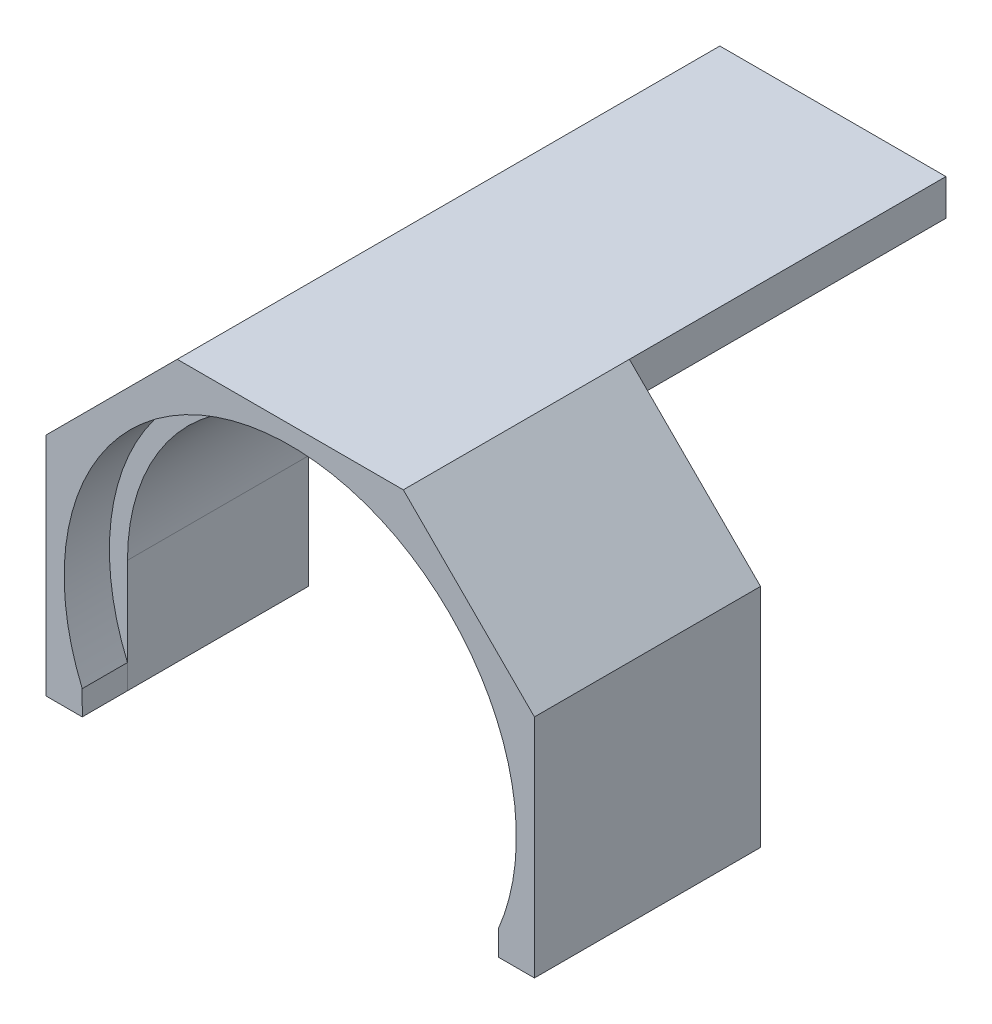
ISO-10303-21;
HEADER;
FILE_DESCRIPTION(('STEP AP214'),'2;1');
FILE_NAME('part.step','',(''),(''),'','','');
FILE_SCHEMA(('AUTOMOTIVE_DESIGN { 1 0 10303 214 1 1 1 1 }'));
ENDSEC;
DATA;
#1=APPLICATION_CONTEXT('core data for automotive mechanical design processes');
#2=APPLICATION_PROTOCOL_DEFINITION('international standard','automotive_design',2000,#1);
#3=PRODUCT_CONTEXT('',#1,'mechanical');
#4=PRODUCT('Part','Part','',(#3));
#5=PRODUCT_RELATED_PRODUCT_CATEGORY('part','',(#4));
#6=PRODUCT_DEFINITION_FORMATION('','',#4);
#7=PRODUCT_DEFINITION_CONTEXT('part definition',#1,'design');
#8=PRODUCT_DEFINITION('design','',#6,#7);
#9=PRODUCT_DEFINITION_SHAPE('','',#8);
#10=(LENGTH_UNIT() NAMED_UNIT(*) SI_UNIT(.MILLI.,.METRE.));
#11=(NAMED_UNIT(*) PLANE_ANGLE_UNIT() SI_UNIT($,.RADIAN.));
#12=(NAMED_UNIT(*) SI_UNIT($,.STERADIAN.) SOLID_ANGLE_UNIT());
#13=UNCERTAINTY_MEASURE_WITH_UNIT(LENGTH_MEASURE(1.E-05),#10,'distance_accuracy_value','');
#14=(GEOMETRIC_REPRESENTATION_CONTEXT(3) GLOBAL_UNCERTAINTY_ASSIGNED_CONTEXT((#13)) GLOBAL_UNIT_ASSIGNED_CONTEXT((#10,
#11,#12)) REPRESENTATION_CONTEXT('',''));
#15=CARTESIAN_POINT('',(0.,0.,0.));
#16=DIRECTION('',(0.,0.,1.));
#17=DIRECTION('',(1.,0.,0.));
#18=AXIS2_PLACEMENT_3D('',#15,#16,#17);
#19=CARTESIAN_POINT('',(0.,0.,110.));
#20=DIRECTION('',(0.,0.,1.));
#21=DIRECTION('',(1.,0.,0.));
#22=AXIS2_PLACEMENT_3D('',#19,#20,#21);
#23=PLANE('',#22);
#24=CARTESIAN_POINT('',(0.,-50.,110.));
#25=DIRECTION('',(0.,0.,-1.));
#26=DIRECTION('',(1.,0.,0.));
#27=AXIS2_PLACEMENT_3D('',#24,#25,#26);
#28=CIRCLE('',#27,50.);
#29=CARTESIAN_POINT('',(-46.0023323000082,-69.5849645146475,110.));
#30=VERTEX_POINT('',#29);
#31=CARTESIAN_POINT('',(46.,-69.5959179422654,110.));
#32=VERTEX_POINT('',#31);
#33=EDGE_CURVE('E54',#30,#32,#28,.T.);
#34=ORIENTED_EDGE('',*,*,#33,.F.);
#35=DIRECTION('',(0.,1.,0.));
#36=VECTOR('',#35,1.);
#37=CARTESIAN_POINT('',(-46.,-50.,110.));
#38=LINE('',#37,#36);
#39=CARTESIAN_POINT('',(-46.,-50.,110.));
#40=VERTEX_POINT('',#39);
#41=EDGE_CURVE('E175',#30,#40,#38,.T.);
#42=ORIENTED_EDGE('',*,*,#41,.T.);
#43=CARTESIAN_POINT('',(0.,-50.,110.));
#44=DIRECTION('',(0.,0.,-1.));
#45=DIRECTION('',(1.,0.,0.));
#46=AXIS2_PLACEMENT_3D('',#43,#44,#45);
#47=CIRCLE('',#46,46.);
#48=CARTESIAN_POINT('',(46.,-50.,110.));
#49=VERTEX_POINT('',#48);
#50=EDGE_CURVE('E402',#40,#49,#47,.T.);
#51=ORIENTED_EDGE('',*,*,#50,.T.);
#52=DIRECTION('',(0.,-1.,0.));
#53=VECTOR('',#52,1.);
#54=CARTESIAN_POINT('',(46.,-50.,110.));
#55=LINE('',#54,#53);
#56=EDGE_CURVE('E401',#49,#32,#55,.T.);
#57=ORIENTED_EDGE('',*,*,#56,.T.);
#58=EDGE_LOOP('',(#34,#42,#51,#57));
#59=FACE_BOUND('',#58,.T.);
#60=ADVANCED_FACE('F36',(#59),#23,.T.);
#61=CARTESIAN_POINT('',(-25.,4.,0.));
#62=DIRECTION('',(-1.,0.,0.));
#63=DIRECTION('',(0.,0.,1.));
#64=AXIS2_PLACEMENT_3D('',#61,#62,#63);
#65=PLANE('',#64);
#66=DIRECTION('',(0.,0.,1.));
#67=VECTOR('',#66,1.);
#68=CARTESIAN_POINT('',(-25.,-4.,0.));
#69=LINE('',#68,#67);
#70=CARTESIAN_POINT('',(-25.,-4.,0.));
#71=VERTEX_POINT('',#70);
#72=CARTESIAN_POINT('',(-25.,-4.,70.));
#73=VERTEX_POINT('',#72);
#74=EDGE_CURVE('E358',#71,#73,#69,.T.);
#75=ORIENTED_EDGE('',*,*,#74,.T.);
#76=DIRECTION('',(0.,1.,0.));
#77=VECTOR('',#76,1.);
#78=CARTESIAN_POINT('',(-25.,4.,70.));
#79=LINE('',#78,#77);
#80=CARTESIAN_POINT('',(-25.,4.,70.));
#81=VERTEX_POINT('',#80);
#82=EDGE_CURVE('E351',#73,#81,#79,.T.);
#83=ORIENTED_EDGE('',*,*,#82,.T.);
#84=DIRECTION('',(0.,0.,1.));
#85=VECTOR('',#84,1.);
#86=CARTESIAN_POINT('',(-25.,4.,0.));
#87=LINE('',#86,#85);
#88=CARTESIAN_POINT('',(-25.,4.,0.));
#89=VERTEX_POINT('',#88);
#90=EDGE_CURVE('E361',#89,#81,#87,.T.);
#91=ORIENTED_EDGE('',*,*,#90,.F.);
#92=DIRECTION('',(0.,-1.,0.));
#93=VECTOR('',#92,1.);
#94=CARTESIAN_POINT('',(-25.,4.,0.));
#95=LINE('',#94,#93);
#96=EDGE_CURVE('E354',#89,#71,#95,.T.);
#97=ORIENTED_EDGE('',*,*,#96,.T.);
#98=EDGE_LOOP('',(#75,#83,#91,#97));
#99=FACE_BOUND('',#98,.T.);
#100=ADVANCED_FACE('F267',(#99),#65,.T.);
#101=CARTESIAN_POINT('',(-25.,-4.,0.));
#102=DIRECTION('',(0.,-1.,0.));
#103=DIRECTION('',(1.,0.,0.));
#104=AXIS2_PLACEMENT_3D('',#101,#102,#103);
#105=PLANE('',#104);
#106=DIRECTION('',(0.,0.,1.));
#107=VECTOR('',#106,1.);
#108=CARTESIAN_POINT('',(25.,-4.,0.));
#109=LINE('',#108,#107);
#110=CARTESIAN_POINT('',(25.,-4.,0.));
#111=VERTEX_POINT('',#110);
#112=CARTESIAN_POINT('',(25.,-4.,70.));
#113=VERTEX_POINT('',#112);
#114=EDGE_CURVE('E46',#111,#113,#109,.T.);
#115=ORIENTED_EDGE('',*,*,#114,.T.);
#116=DIRECTION('',(-1.,0.,0.));
#117=VECTOR('',#116,1.);
#118=CARTESIAN_POINT('',(-25.,-4.,70.));
#119=LINE('',#118,#117);
#120=CARTESIAN_POINT('',(0.,-4.,70.));
#121=VERTEX_POINT('',#120);
#122=EDGE_CURVE('E347',#113,#121,#119,.T.);
#123=ORIENTED_EDGE('',*,*,#122,.T.);
#124=EDGE_CURVE('E350',#121,#73,#119,.T.);
#125=ORIENTED_EDGE('',*,*,#124,.T.);
#126=ORIENTED_EDGE('',*,*,#74,.F.);
#127=DIRECTION('',(1.,0.,0.));
#128=VECTOR('',#127,1.);
#129=CARTESIAN_POINT('',(-25.,-4.,0.));
#130=LINE('',#129,#128);
#131=EDGE_CURVE('E357',#71,#111,#130,.T.);
#132=ORIENTED_EDGE('',*,*,#131,.T.);
#133=EDGE_LOOP('',(#115,#123,#125,#126,#132));
#134=FACE_BOUND('',#133,.T.);
#135=ADVANCED_FACE('F274',(#134),#105,.T.);
#136=CARTESIAN_POINT('',(25.,4.,0.));
#137=DIRECTION('',(1.,0.,0.));
#138=DIRECTION('',(0.,0.,-1.));
#139=AXIS2_PLACEMENT_3D('',#136,#137,#138);
#140=PLANE('',#139);
#141=DIRECTION('',(0.,0.,1.));
#142=VECTOR('',#141,1.);
#143=CARTESIAN_POINT('',(25.,4.,0.));
#144=LINE('',#143,#142);
#145=CARTESIAN_POINT('',(25.,4.,0.));
#146=VERTEX_POINT('',#145);
#147=CARTESIAN_POINT('',(25.,4.,70.));
#148=VERTEX_POINT('',#147);
#149=EDGE_CURVE('E11',#146,#148,#144,.T.);
#150=ORIENTED_EDGE('',*,*,#149,.T.);
#151=DIRECTION('',(0.,-1.,0.));
#152=VECTOR('',#151,1.);
#153=CARTESIAN_POINT('',(25.,4.,70.));
#154=LINE('',#153,#152);
#155=EDGE_CURVE('E331',#148,#113,#154,.T.);
#156=ORIENTED_EDGE('',*,*,#155,.T.);
#157=ORIENTED_EDGE('',*,*,#114,.F.);
#158=DIRECTION('',(0.,1.,0.));
#159=VECTOR('',#158,1.);
#160=CARTESIAN_POINT('',(25.,4.,0.));
#161=LINE('',#160,#159);
#162=EDGE_CURVE('E366',#111,#146,#161,.T.);
#163=ORIENTED_EDGE('',*,*,#162,.T.);
#164=EDGE_LOOP('',(#150,#156,#157,#163));
#165=FACE_BOUND('',#164,.T.);
#166=ADVANCED_FACE('F271',(#165),#140,.T.);
#167=CARTESIAN_POINT('',(0.,0.,0.));
#168=DIRECTION('',(0.,0.,1.));
#169=DIRECTION('',(1.,0.,0.));
#170=AXIS2_PLACEMENT_3D('',#167,#168,#169);
#171=PLANE('',#170);
#172=ORIENTED_EDGE('',*,*,#96,.F.);
#173=DIRECTION('',(-1.,0.,0.));
#174=VECTOR('',#173,1.);
#175=CARTESIAN_POINT('',(-25.,4.,0.));
#176=LINE('',#175,#174);
#177=EDGE_CURVE('E62',#146,#89,#176,.T.);
#178=ORIENTED_EDGE('',*,*,#177,.F.);
#179=ORIENTED_EDGE('',*,*,#162,.F.);
#180=ORIENTED_EDGE('',*,*,#131,.F.);
#181=EDGE_LOOP('',(#172,#178,#179,#180));
#182=FACE_BOUND('',#181,.T.);
#183=ADVANCED_FACE('F38',(#182),#171,.F.);
#184=CARTESIAN_POINT('',(-25.,4.,0.));
#185=DIRECTION('',(0.,1.,0.));
#186=DIRECTION('',(0.,0.,1.));
#187=AXIS2_PLACEMENT_3D('',#184,#185,#186);
#188=PLANE('',#187);
#189=DIRECTION('',(0.,0.,1.));
#190=VECTOR('',#189,1.);
#191=CARTESIAN_POINT('',(25.,4.,70.));
#192=LINE('',#191,#190);
#193=CARTESIAN_POINT('',(25.,4.,120.));
#194=VERTEX_POINT('',#193);
#195=EDGE_CURVE('E329',#148,#194,#192,.T.);
#196=ORIENTED_EDGE('',*,*,#195,.F.);
#197=ORIENTED_EDGE('',*,*,#149,.F.);
#198=ORIENTED_EDGE('',*,*,#177,.T.);
#199=ORIENTED_EDGE('',*,*,#90,.T.);
#200=DIRECTION('',(0.,0.,1.));
#201=VECTOR('',#200,1.);
#202=CARTESIAN_POINT('',(-25.,4.,70.));
#203=LINE('',#202,#201);
#204=CARTESIAN_POINT('',(-25.,4.,120.));
#205=VERTEX_POINT('',#204);
#206=EDGE_CURVE('E342',#81,#205,#203,.T.);
#207=ORIENTED_EDGE('',*,*,#206,.T.);
#208=DIRECTION('',(-1.,0.,0.));
#209=VECTOR('',#208,1.);
#210=CARTESIAN_POINT('',(-25.,4.,120.));
#211=LINE('',#210,#209);
#212=EDGE_CURVE('E312',#194,#205,#211,.T.);
#213=ORIENTED_EDGE('',*,*,#212,.F.);
#214=EDGE_LOOP('',(#196,#197,#198,#199,#207,#213));
#215=FACE_BOUND('',#214,.T.);
#216=ADVANCED_FACE('F228',(#215),#188,.T.);
#217=CARTESIAN_POINT('',(0.,-50.,70.));
#218=DIRECTION('',(0.,0.,1.));
#219=DIRECTION('',(1.,0.,0.));
#220=AXIS2_PLACEMENT_3D('',#217,#218,#219);
#221=CYLINDRICAL_SURFACE('',#220,46.);
#222=CARTESIAN_POINT('',(0.,-50.,70.));
#223=DIRECTION('',(0.,0.,-1.));
#224=DIRECTION('',(1.,0.,0.));
#225=AXIS2_PLACEMENT_3D('',#222,#223,#224);
#226=CIRCLE('',#225,46.);
#227=CARTESIAN_POINT('',(-46.,-50.,70.));
#228=VERTEX_POINT('',#227);
#229=EDGE_CURVE('E387',#228,#121,#226,.T.);
#230=ORIENTED_EDGE('',*,*,#229,.T.);
#231=CARTESIAN_POINT('',(46.,-50.,70.));
#232=VERTEX_POINT('',#231);
#233=EDGE_CURVE('E382',#121,#232,#226,.T.);
#234=ORIENTED_EDGE('',*,*,#233,.T.);
#235=DIRECTION('',(0.,0.,1.));
#236=VECTOR('',#235,1.);
#237=CARTESIAN_POINT('',(46.,-50.,70.));
#238=LINE('',#237,#236);
#239=EDGE_CURVE('E337',#232,#49,#238,.T.);
#240=ORIENTED_EDGE('',*,*,#239,.T.);
#241=ORIENTED_EDGE('',*,*,#50,.F.);
#242=DIRECTION('',(0.,0.,1.));
#243=VECTOR('',#242,1.);
#244=CARTESIAN_POINT('',(-46.,-50.,70.));
#245=LINE('',#244,#243);
#246=EDGE_CURVE('E339',#228,#40,#245,.T.);
#247=ORIENTED_EDGE('',*,*,#246,.F.);
#248=EDGE_LOOP('',(#230,#234,#240,#241,#247));
#249=FACE_BOUND('',#248,.T.);
#250=ADVANCED_FACE('F225',(#249),#221,.F.);
#251=CARTESIAN_POINT('',(0.,-50.,70.));
#252=DIRECTION('',(0.,0.,1.));
#253=DIRECTION('',(1.,0.,0.));
#254=AXIS2_PLACEMENT_3D('',#251,#252,#253);
#255=PLANE('',#254);
#256=ORIENTED_EDGE('',*,*,#82,.F.);
#257=ORIENTED_EDGE('',*,*,#124,.F.);
#258=ORIENTED_EDGE('',*,*,#229,.F.);
#259=DIRECTION('',(0.,1.,0.));
#260=VECTOR('',#259,1.);
#261=CARTESIAN_POINT('',(-46.,-50.,70.));
#262=LINE('',#261,#260);
#263=CARTESIAN_POINT('',(-46.,-75.,70.));
#264=VERTEX_POINT('',#263);
#265=EDGE_CURVE('E388',#264,#228,#262,.T.);
#266=ORIENTED_EDGE('',*,*,#265,.F.);
#267=DIRECTION('',(1.,0.,0.));
#268=VECTOR('',#267,1.);
#269=CARTESIAN_POINT('',(-54.,-75.,70.));
#270=LINE('',#269,#268);
#271=CARTESIAN_POINT('',(-54.,-75.,70.));
#272=VERTEX_POINT('',#271);
#273=EDGE_CURVE('E410',#272,#264,#270,.T.);
#274=ORIENTED_EDGE('',*,*,#273,.F.);
#275=DIRECTION('',(0.,-1.,0.));
#276=VECTOR('',#275,1.);
#277=CARTESIAN_POINT('',(-54.,-25.,70.));
#278=LINE('',#277,#276);
#279=CARTESIAN_POINT('',(-54.,-25.,70.));
#280=VERTEX_POINT('',#279);
#281=EDGE_CURVE('E297',#280,#272,#278,.T.);
#282=ORIENTED_EDGE('',*,*,#281,.F.);
#283=DIRECTION('',(-0.707106781186548,-0.707106781186548,0.));
#284=VECTOR('',#283,1.);
#285=CARTESIAN_POINT('',(-54.,-25.,70.));
#286=LINE('',#285,#284);
#287=EDGE_CURVE('E380',#81,#280,#286,.T.);
#288=ORIENTED_EDGE('',*,*,#287,.F.);
#289=EDGE_LOOP('',(#256,#257,#258,#266,#274,#282,#288));
#290=FACE_BOUND('',#289,.T.);
#291=ADVANCED_FACE('F209',(#290),#255,.F.);
#292=CARTESIAN_POINT('',(25.,4.,70.));
#293=DIRECTION('',(0.707106781186548,0.707106781186548,0.));
#294=DIRECTION('',(-0.707106781186548,0.707106781186548,0.));
#295=AXIS2_PLACEMENT_3D('',#292,#293,#294);
#296=PLANE('',#295);
#297=ORIENTED_EDGE('',*,*,#195,.T.);
#298=DIRECTION('',(-0.707106781186548,0.707106781186548,0.));
#299=VECTOR('',#298,1.);
#300=CARTESIAN_POINT('',(25.,4.,120.));
#301=LINE('',#300,#299);
#302=CARTESIAN_POINT('',(54.,-25.,120.));
#303=VERTEX_POINT('',#302);
#304=EDGE_CURVE('E314',#303,#194,#301,.T.);
#305=ORIENTED_EDGE('',*,*,#304,.F.);
#306=DIRECTION('',(0.,0.,1.));
#307=VECTOR('',#306,1.);
#308=CARTESIAN_POINT('',(54.,-25.,70.));
#309=LINE('',#308,#307);
#310=CARTESIAN_POINT('',(54.,-25.,70.));
#311=VERTEX_POINT('',#310);
#312=EDGE_CURVE('E325',#311,#303,#309,.T.);
#313=ORIENTED_EDGE('',*,*,#312,.F.);
#314=DIRECTION('',(-0.707106781186548,0.707106781186548,0.));
#315=VECTOR('',#314,1.);
#316=CARTESIAN_POINT('',(25.,4.,70.));
#317=LINE('',#316,#315);
#318=EDGE_CURVE('E344',#311,#148,#317,.T.);
#319=ORIENTED_EDGE('',*,*,#318,.T.);
#320=EDGE_LOOP('',(#297,#305,#313,#319));
#321=FACE_BOUND('',#320,.T.);
#322=ADVANCED_FACE('F210',(#321),#296,.T.);
#323=CARTESIAN_POINT('',(54.,-25.,70.));
#324=DIRECTION('',(1.,0.,0.));
#325=DIRECTION('',(0.,1.,0.));
#326=AXIS2_PLACEMENT_3D('',#323,#324,#325);
#327=PLANE('',#326);
#328=ORIENTED_EDGE('',*,*,#312,.T.);
#329=DIRECTION('',(0.,1.,0.));
#330=VECTOR('',#329,1.);
#331=CARTESIAN_POINT('',(54.,-25.,120.));
#332=LINE('',#331,#330);
#333=CARTESIAN_POINT('',(54.,-75.,120.));
#334=VERTEX_POINT('',#333);
#335=EDGE_CURVE('E317',#334,#303,#332,.T.);
#336=ORIENTED_EDGE('',*,*,#335,.F.);
#337=DIRECTION('',(0.,0.,1.));
#338=VECTOR('',#337,1.);
#339=CARTESIAN_POINT('',(54.,-75.,70.));
#340=LINE('',#339,#338);
#341=CARTESIAN_POINT('',(54.,-75.,70.));
#342=VERTEX_POINT('',#341);
#343=EDGE_CURVE('E323',#342,#334,#340,.T.);
#344=ORIENTED_EDGE('',*,*,#343,.F.);
#345=DIRECTION('',(0.,1.,0.));
#346=VECTOR('',#345,1.);
#347=CARTESIAN_POINT('',(54.,-25.,70.));
#348=LINE('',#347,#346);
#349=EDGE_CURVE('E326',#342,#311,#348,.T.);
#350=ORIENTED_EDGE('',*,*,#349,.T.);
#351=EDGE_LOOP('',(#328,#336,#344,#350));
#352=FACE_BOUND('',#351,.T.);
#353=ADVANCED_FACE('F213',(#352),#327,.T.);
#354=CARTESIAN_POINT('',(46.,-75.,70.));
#355=DIRECTION('',(0.,-1.,0.));
#356=DIRECTION('',(0.,0.,-1.));
#357=AXIS2_PLACEMENT_3D('',#354,#355,#356);
#358=PLANE('',#357);
#359=ORIENTED_EDGE('',*,*,#343,.T.);
#360=DIRECTION('',(1.,0.,0.));
#361=VECTOR('',#360,1.);
#362=CARTESIAN_POINT('',(54.,-75.,120.));
#363=LINE('',#362,#361);
#364=CARTESIAN_POINT('',(46.,-75.,120.));
#365=VERTEX_POINT('',#364);
#366=EDGE_CURVE('E163',#365,#334,#363,.T.);
#367=ORIENTED_EDGE('',*,*,#366,.F.);
#368=DIRECTION('',(0.,0.,1.));
#369=VECTOR('',#368,1.);
#370=CARTESIAN_POINT('',(46.,-75.,70.));
#371=LINE('',#370,#369);
#372=CARTESIAN_POINT('',(46.,-75.,70.));
#373=VERTEX_POINT('',#372);
#374=EDGE_CURVE('E159',#373,#365,#371,.T.);
#375=ORIENTED_EDGE('',*,*,#374,.F.);
#376=DIRECTION('',(1.,0.,0.));
#377=VECTOR('',#376,1.);
#378=CARTESIAN_POINT('',(46.,-75.,70.));
#379=LINE('',#378,#377);
#380=EDGE_CURVE('E393',#373,#342,#379,.T.);
#381=ORIENTED_EDGE('',*,*,#380,.T.);
#382=EDGE_LOOP('',(#359,#367,#375,#381));
#383=FACE_BOUND('',#382,.T.);
#384=ADVANCED_FACE('F217',(#383),#358,.T.);
#385=CARTESIAN_POINT('',(46.,-50.,70.));
#386=DIRECTION('',(-1.,0.,0.));
#387=DIRECTION('',(0.,0.,1.));
#388=AXIS2_PLACEMENT_3D('',#385,#386,#387);
#389=PLANE('',#388);
#390=ORIENTED_EDGE('',*,*,#56,.F.);
#391=ORIENTED_EDGE('',*,*,#239,.F.);
#392=DIRECTION('',(0.,-1.,0.));
#393=VECTOR('',#392,1.);
#394=CARTESIAN_POINT('',(46.,-50.,70.));
#395=LINE('',#394,#393);
#396=EDGE_CURVE('E385',#232,#373,#395,.T.);
#397=ORIENTED_EDGE('',*,*,#396,.T.);
#398=ORIENTED_EDGE('',*,*,#374,.T.);
#399=DIRECTION('',(0.,-1.,0.));
#400=VECTOR('',#399,1.);
#401=CARTESIAN_POINT('',(46.,-69.5959179422654,120.));
#402=LINE('',#401,#400);
#403=CARTESIAN_POINT('',(46.,-69.5959179422654,120.));
#404=VERTEX_POINT('',#403);
#405=EDGE_CURVE('E152',#404,#365,#402,.T.);
#406=ORIENTED_EDGE('',*,*,#405,.F.);
#407=DIRECTION('',(0.,0.,-1.));
#408=VECTOR('',#407,1.);
#409=CARTESIAN_POINT('',(46.,-69.5959179422654,120.));
#410=LINE('',#409,#408);
#411=EDGE_CURVE('E157',#404,#32,#410,.T.);
#412=ORIENTED_EDGE('',*,*,#411,.T.);
#413=EDGE_LOOP('',(#390,#391,#397,#398,#406,#412));
#414=FACE_BOUND('',#413,.T.);
#415=ADVANCED_FACE('F155',(#414),#389,.T.);
#416=CARTESIAN_POINT('',(-46.,-50.,70.));
#417=DIRECTION('',(1.,0.,0.));
#418=DIRECTION('',(0.,0.,-1.));
#419=AXIS2_PLACEMENT_3D('',#416,#417,#418);
#420=PLANE('',#419);
#421=CARTESIAN_POINT('',(-46.,-75.,110.));
#422=VERTEX_POINT('',#421);
#423=EDGE_CURVE('E40',#422,#30,#38,.T.);
#424=ORIENTED_EDGE('',*,*,#423,.F.);
#425=DIRECTION('',(0.,0.,1.));
#426=VECTOR('',#425,1.);
#427=CARTESIAN_POINT('',(-46.,-75.,70.));
#428=LINE('',#427,#426);
#429=EDGE_CURVE('E242',#264,#422,#428,.T.);
#430=ORIENTED_EDGE('',*,*,#429,.F.);
#431=ORIENTED_EDGE('',*,*,#265,.T.);
#432=ORIENTED_EDGE('',*,*,#246,.T.);
#433=ORIENTED_EDGE('',*,*,#41,.F.);
#434=EDGE_LOOP('',(#424,#430,#431,#432,#433));
#435=FACE_BOUND('',#434,.T.);
#436=ADVANCED_FACE('F224',(#435),#420,.T.);
#437=CARTESIAN_POINT('',(-54.,-75.,70.));
#438=DIRECTION('',(0.,-1.,0.));
#439=DIRECTION('',(0.,0.,-1.));
#440=AXIS2_PLACEMENT_3D('',#437,#438,#439);
#441=PLANE('',#440);
#442=ORIENTED_EDGE('',*,*,#429,.T.);
#443=DIRECTION('',(0.,0.,-1.));
#444=VECTOR('',#443,1.);
#445=CARTESIAN_POINT('',(-46.,-75.,120.));
#446=LINE('',#445,#444);
#447=CARTESIAN_POINT('',(-46.,-75.,120.));
#448=VERTEX_POINT('',#447);
#449=EDGE_CURVE('E176',#448,#422,#446,.T.);
#450=ORIENTED_EDGE('',*,*,#449,.F.);
#451=DIRECTION('',(1.,0.,0.));
#452=VECTOR('',#451,1.);
#453=CARTESIAN_POINT('',(-46.,-75.,120.));
#454=LINE('',#453,#452);
#455=CARTESIAN_POINT('',(-54.,-75.,120.));
#456=VERTEX_POINT('',#455);
#457=EDGE_CURVE('E304',#456,#448,#454,.T.);
#458=ORIENTED_EDGE('',*,*,#457,.F.);
#459=DIRECTION('',(0.,0.,1.));
#460=VECTOR('',#459,1.);
#461=CARTESIAN_POINT('',(-54.,-75.,70.));
#462=LINE('',#461,#460);
#463=EDGE_CURVE('E293',#272,#456,#462,.T.);
#464=ORIENTED_EDGE('',*,*,#463,.F.);
#465=ORIENTED_EDGE('',*,*,#273,.T.);
#466=EDGE_LOOP('',(#442,#450,#458,#464,#465));
#467=FACE_BOUND('',#466,.T.);
#468=ADVANCED_FACE('F233',(#467),#441,.T.);
#469=CARTESIAN_POINT('',(-54.,-25.,70.));
#470=DIRECTION('',(-1.,0.,0.));
#471=DIRECTION('',(0.,-1.,0.));
#472=AXIS2_PLACEMENT_3D('',#469,#470,#471);
#473=PLANE('',#472);
#474=ORIENTED_EDGE('',*,*,#463,.T.);
#475=DIRECTION('',(0.,-1.,0.));
#476=VECTOR('',#475,1.);
#477=CARTESIAN_POINT('',(-54.,-75.,120.));
#478=LINE('',#477,#476);
#479=CARTESIAN_POINT('',(-54.,-25.,120.));
#480=VERTEX_POINT('',#479);
#481=EDGE_CURVE('E295',#480,#456,#478,.T.);
#482=ORIENTED_EDGE('',*,*,#481,.F.);
#483=DIRECTION('',(0.,0.,1.));
#484=VECTOR('',#483,1.);
#485=CARTESIAN_POINT('',(-54.,-25.,70.));
#486=LINE('',#485,#484);
#487=EDGE_CURVE('E301',#280,#480,#486,.T.);
#488=ORIENTED_EDGE('',*,*,#487,.F.);
#489=ORIENTED_EDGE('',*,*,#281,.T.);
#490=EDGE_LOOP('',(#474,#482,#488,#489));
#491=FACE_BOUND('',#490,.T.);
#492=ADVANCED_FACE('F283',(#491),#473,.T.);
#493=CARTESIAN_POINT('',(-54.,-25.,70.));
#494=DIRECTION('',(-0.707106781186548,0.707106781186548,0.));
#495=DIRECTION('',(-0.707106781186548,-0.707106781186548,0.));
#496=AXIS2_PLACEMENT_3D('',#493,#494,#495);
#497=PLANE('',#496);
#498=ORIENTED_EDGE('',*,*,#487,.T.);
#499=DIRECTION('',(-0.707106781186548,-0.707106781186548,0.));
#500=VECTOR('',#499,1.);
#501=CARTESIAN_POINT('',(-54.,-25.,120.));
#502=LINE('',#501,#500);
#503=EDGE_CURVE('E308',#205,#480,#502,.T.);
#504=ORIENTED_EDGE('',*,*,#503,.F.);
#505=ORIENTED_EDGE('',*,*,#206,.F.);
#506=ORIENTED_EDGE('',*,*,#287,.T.);
#507=EDGE_LOOP('',(#498,#504,#505,#506));
#508=FACE_BOUND('',#507,.T.);
#509=ADVANCED_FACE('F207',(#508),#497,.T.);
#510=ORIENTED_EDGE('',*,*,#122,.F.);
#511=ORIENTED_EDGE('',*,*,#155,.F.);
#512=ORIENTED_EDGE('',*,*,#318,.F.);
#513=ORIENTED_EDGE('',*,*,#349,.F.);
#514=ORIENTED_EDGE('',*,*,#380,.F.);
#515=ORIENTED_EDGE('',*,*,#396,.F.);
#516=ORIENTED_EDGE('',*,*,#233,.F.);
#517=EDGE_LOOP('',(#510,#511,#512,#513,#514,#515,#516));
#518=FACE_BOUND('',#517,.T.);
#519=ADVANCED_FACE('F204',(#518),#255,.F.);
#520=CARTESIAN_POINT('',(0.,-50.,120.));
#521=DIRECTION('',(0.,0.,-1.));
#522=DIRECTION('',(-1.,0.,0.));
#523=AXIS2_PLACEMENT_3D('',#520,#521,#522);
#524=CYLINDRICAL_SURFACE('',#523,50.);
#525=ORIENTED_EDGE('',*,*,#33,.T.);
#526=ORIENTED_EDGE('',*,*,#411,.F.);
#527=CARTESIAN_POINT('',(0.,-50.,120.));
#528=DIRECTION('',(0.,0.,-1.));
#529=DIRECTION('',(1.,0.,0.));
#530=AXIS2_PLACEMENT_3D('',#527,#528,#529);
#531=CIRCLE('',#530,50.);
#532=CARTESIAN_POINT('',(-46.0046646000164,-69.5849645146475,120.));
#533=VERTEX_POINT('',#532);
#534=EDGE_CURVE('E164',#533,#404,#531,.T.);
#535=ORIENTED_EDGE('',*,*,#534,.F.);
#536=DIRECTION('',(0.,0.,-1.));
#537=VECTOR('',#536,1.);
#538=CARTESIAN_POINT('',(-46.0046646000164,-69.5849645146475,120.));
#539=LINE('',#538,#537);
#540=EDGE_CURVE('E179',#533,#30,#539,.T.);
#541=ORIENTED_EDGE('',*,*,#540,.T.);
#542=EDGE_LOOP('',(#525,#526,#535,#541));
#543=FACE_BOUND('',#542,.T.);
#544=ADVANCED_FACE('F174',(#543),#524,.F.);
#545=CARTESIAN_POINT('',(-46.0046646000164,-69.5849645146475,120.));
#546=DIRECTION('',(-0.999999628981156,-0.000861416014415323,0.));
#547=DIRECTION('',(0.000861416014415323,-0.999999628981156,0.));
#548=AXIS2_PLACEMENT_3D('',#545,#546,#547);
#549=PLANE('',#548);
#550=ORIENTED_EDGE('',*,*,#423,.T.);
#551=ORIENTED_EDGE('',*,*,#540,.F.);
#552=DIRECTION('',(-0.000861416014415323,0.999999628981156,0.));
#553=VECTOR('',#552,1.);
#554=CARTESIAN_POINT('',(-46.0046646000164,-69.5849645146475,120.));
#555=LINE('',#554,#553);
#556=EDGE_CURVE('E169',#448,#533,#555,.T.);
#557=ORIENTED_EDGE('',*,*,#556,.F.);
#558=ORIENTED_EDGE('',*,*,#449,.T.);
#559=EDGE_LOOP('',(#550,#551,#557,#558));
#560=FACE_BOUND('',#559,.T.);
#561=ADVANCED_FACE('F192',(#560),#549,.F.);
#562=CARTESIAN_POINT('',(0.,-50.,120.));
#563=DIRECTION('',(0.,0.,1.));
#564=DIRECTION('',(1.,0.,0.));
#565=AXIS2_PLACEMENT_3D('',#562,#563,#564);
#566=PLANE('',#565);
#567=ORIENTED_EDGE('',*,*,#534,.T.);
#568=ORIENTED_EDGE('',*,*,#405,.T.);
#569=ORIENTED_EDGE('',*,*,#366,.T.);
#570=ORIENTED_EDGE('',*,*,#335,.T.);
#571=ORIENTED_EDGE('',*,*,#304,.T.);
#572=ORIENTED_EDGE('',*,*,#212,.T.);
#573=ORIENTED_EDGE('',*,*,#503,.T.);
#574=ORIENTED_EDGE('',*,*,#481,.T.);
#575=ORIENTED_EDGE('',*,*,#457,.T.);
#576=ORIENTED_EDGE('',*,*,#556,.T.);
#577=EDGE_LOOP('',(#567,#568,#569,#570,#571,#572,#573,#574,#575,#576));
#578=FACE_BOUND('',#577,.T.);
#579=ADVANCED_FACE('F167',(#578),#566,.T.);
#580=CLOSED_SHELL('',(#60,#100,#135,#166,#183,#216,#250,#291,#322,#353,#384,#415,#436,#468,#492,
#509,#519,#544,#561,#579));
#581=MANIFOLD_SOLID_BREP('B2',#580);
#582=ADVANCED_BREP_SHAPE_REPRESENTATION('',(#18,#581),#14);
#583=SHAPE_DEFINITION_REPRESENTATION(#9,#582);
ENDSEC;
END-ISO-10303-21;
